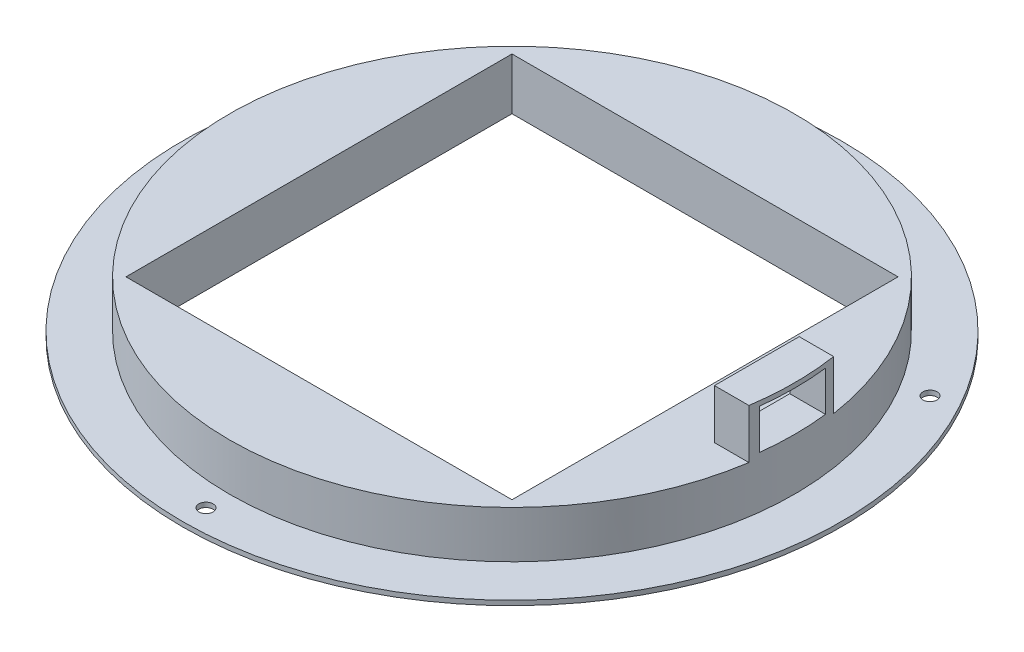
ISO-10303-21;
HEADER;
FILE_DESCRIPTION(('STEP AP214'),'2;1');
FILE_NAME('part.step','',(''),(''),'','','');
FILE_SCHEMA(('AUTOMOTIVE_DESIGN { 1 0 10303 214 1 1 1 1 }'));
ENDSEC;
DATA;
#1=APPLICATION_CONTEXT('core data for automotive mechanical design processes');
#2=APPLICATION_PROTOCOL_DEFINITION('international standard','automotive_design',2000,#1);
#3=PRODUCT_CONTEXT('',#1,'mechanical');
#4=PRODUCT('Part','Part','',(#3));
#5=PRODUCT_RELATED_PRODUCT_CATEGORY('part','',(#4));
#6=PRODUCT_DEFINITION_FORMATION('','',#4);
#7=PRODUCT_DEFINITION_CONTEXT('part definition',#1,'design');
#8=PRODUCT_DEFINITION('design','',#6,#7);
#9=PRODUCT_DEFINITION_SHAPE('','',#8);
#10=(LENGTH_UNIT() NAMED_UNIT(*) SI_UNIT(.MILLI.,.METRE.));
#11=(NAMED_UNIT(*) PLANE_ANGLE_UNIT() SI_UNIT($,.RADIAN.));
#12=(NAMED_UNIT(*) SI_UNIT($,.STERADIAN.) SOLID_ANGLE_UNIT());
#13=UNCERTAINTY_MEASURE_WITH_UNIT(LENGTH_MEASURE(1.E-05),#10,'distance_accuracy_value','');
#14=(GEOMETRIC_REPRESENTATION_CONTEXT(3) GLOBAL_UNCERTAINTY_ASSIGNED_CONTEXT((#13)) GLOBAL_UNIT_ASSIGNED_CONTEXT((#10,
#11,#12)) REPRESENTATION_CONTEXT('',''));
#15=CARTESIAN_POINT('',(0.,0.,0.));
#16=DIRECTION('',(0.,0.,1.));
#17=DIRECTION('',(1.,0.,0.));
#18=AXIS2_PLACEMENT_3D('',#15,#16,#17);
#19=CARTESIAN_POINT('',(-86.9016428172304,71.9761170199418,0.));
#20=DIRECTION('',(0.,1.,0.));
#21=DIRECTION('',(0.,0.,1.));
#22=AXIS2_PLACEMENT_3D('',#19,#20,#21);
#23=PLANE('',#22);
#24=DIRECTION('',(-1.,0.,0.));
#25=VECTOR('',#24,1.);
#26=CARTESIAN_POINT('',(32.4195169826252,71.9761170199418,-9.));
#27=LINE('',#26,#25);
#28=CARTESIAN_POINT('',(32.4195169826252,71.9761170199418,-9.));
#29=VERTEX_POINT('',#28);
#30=CARTESIAN_POINT('',(25.0983571827696,71.9761170199418,-9.));
#31=VERTEX_POINT('',#30);
#32=EDGE_CURVE('E162',#29,#31,#27,.T.);
#33=ORIENTED_EDGE('',*,*,#32,.F.);
#34=CARTESIAN_POINT('',(-26.9016428172304,71.9761170199418,0.));
#35=DIRECTION('',(0.,1.,0.));
#36=DIRECTION('',(0.,0.,1.));
#37=AXIS2_PLACEMENT_3D('',#34,#35,#36);
#38=CIRCLE('',#37,60.);
#39=CARTESIAN_POINT('',(32.4195169826252,71.9761170199418,9.));
#40=VERTEX_POINT('',#39);
#41=EDGE_CURVE('E11',#29,#40,#38,.T.);
#42=ORIENTED_EDGE('',*,*,#41,.T.);
#43=DIRECTION('',(1.,0.,0.));
#44=VECTOR('',#43,1.);
#45=CARTESIAN_POINT('',(25.0983571827696,71.9761170199418,9.));
#46=LINE('',#45,#44);
#47=CARTESIAN_POINT('',(25.0983571827696,71.9761170199418,9.));
#48=VERTEX_POINT('',#47);
#49=EDGE_CURVE('E171',#48,#40,#46,.T.);
#50=ORIENTED_EDGE('',*,*,#49,.F.);
#51=DIRECTION('',(0.,0.,1.));
#52=VECTOR('',#51,1.);
#53=CARTESIAN_POINT('',(25.0983571827696,71.9761170199418,-9.));
#54=LINE('',#53,#52);
#55=EDGE_CURVE('E157',#31,#48,#54,.T.);
#56=ORIENTED_EDGE('',*,*,#55,.F.);
#57=EDGE_LOOP('',(#33,#42,#50,#56));
#58=FACE_BOUND('',#57,.T.);
#59=DIRECTION('',(-1.,0.,0.));
#60=VECTOR('',#59,1.);
#61=CARTESIAN_POINT('',(14.0983571827696,71.9761170199418,-41.));
#62=LINE('',#61,#60);
#63=CARTESIAN_POINT('',(14.0983571827696,71.9761170199418,-41.));
#64=VERTEX_POINT('',#63);
#65=CARTESIAN_POINT('',(-67.9016428172304,71.9761170199418,-41.));
#66=VERTEX_POINT('',#65);
#67=EDGE_CURVE('E252',#64,#66,#62,.T.);
#68=ORIENTED_EDGE('',*,*,#67,.F.);
#69=DIRECTION('',(0.,0.,-1.));
#70=VECTOR('',#69,1.);
#71=CARTESIAN_POINT('',(14.0983571827696,71.9761170199418,41.));
#72=LINE('',#71,#70);
#73=CARTESIAN_POINT('',(14.0983571827696,71.9761170199418,41.));
#74=VERTEX_POINT('',#73);
#75=EDGE_CURVE('E260',#74,#64,#72,.T.);
#76=ORIENTED_EDGE('',*,*,#75,.F.);
#77=DIRECTION('',(1.,0.,0.));
#78=VECTOR('',#77,1.);
#79=CARTESIAN_POINT('',(14.0983571827696,71.9761170199418,41.));
#80=LINE('',#79,#78);
#81=CARTESIAN_POINT('',(-67.9016428172304,71.9761170199418,41.));
#82=VERTEX_POINT('',#81);
#83=EDGE_CURVE('E262',#82,#74,#80,.T.);
#84=ORIENTED_EDGE('',*,*,#83,.F.);
#85=DIRECTION('',(0.,0.,1.));
#86=VECTOR('',#85,1.);
#87=CARTESIAN_POINT('',(-67.9016428172304,71.9761170199418,41.));
#88=LINE('',#87,#86);
#89=EDGE_CURVE('E265',#66,#82,#88,.T.);
#90=ORIENTED_EDGE('',*,*,#89,.F.);
#91=EDGE_LOOP('',(#68,#76,#84,#90));
#92=FACE_BOUND('',#91,.T.);
#93=ADVANCED_FACE('F33',(#58,#92),#23,.T.);
#94=CARTESIAN_POINT('',(-26.9016428172304,46.9761170199418,0.));
#95=DIRECTION('',(0.,1.,0.));
#96=DIRECTION('',(0.,0.,1.));
#97=AXIS2_PLACEMENT_3D('',#94,#95,#96);
#98=CYLINDRICAL_SURFACE('',#97,60.);
#99=DIRECTION('',(0.,1.,0.));
#100=VECTOR('',#99,1.);
#101=CARTESIAN_POINT('',(32.688624844528,46.9761170199418,6.99999999999999));
#102=LINE('',#101,#100);
#103=CARTESIAN_POINT('',(32.688624844528,81.4761170199418,6.99999999999998));
#104=VERTEX_POINT('',#103);
#105=CARTESIAN_POINT('',(32.688624844528,72.9761170199418,6.99999999999998));
#106=VERTEX_POINT('',#105);
#107=EDGE_CURVE('E155',#104,#106,#102,.F.);
#108=ORIENTED_EDGE('',*,*,#107,.F.);
#109=CARTESIAN_POINT('',(-26.9016428172304,81.4761170199418,0.));
#110=DIRECTION('',(0.,1.,0.));
#111=DIRECTION('',(0.,0.,1.));
#112=AXIS2_PLACEMENT_3D('',#109,#110,#111);
#113=CIRCLE('',#112,60.);
#114=CARTESIAN_POINT('',(32.688624844528,81.4761170199418,-7.00000000000001));
#115=VERTEX_POINT('',#114);
#116=EDGE_CURVE('E148',#115,#104,#113,.F.);
#117=ORIENTED_EDGE('',*,*,#116,.F.);
#118=DIRECTION('',(0.,1.,0.));
#119=VECTOR('',#118,1.);
#120=CARTESIAN_POINT('',(32.688624844528,46.9761170199418,-7.00000000000001));
#121=LINE('',#120,#119);
#122=CARTESIAN_POINT('',(32.688624844528,72.9761170199418,-7.00000000000002));
#123=VERTEX_POINT('',#122);
#124=EDGE_CURVE('E128',#123,#115,#121,.T.);
#125=ORIENTED_EDGE('',*,*,#124,.F.);
#126=CARTESIAN_POINT('',(-26.9016428172304,72.9761170199418,0.));
#127=DIRECTION('',(0.,-1.,0.));
#128=DIRECTION('',(0.,0.,-1.));
#129=AXIS2_PLACEMENT_3D('',#126,#127,#128);
#130=CIRCLE('',#129,60.);
#131=EDGE_CURVE('E153',#106,#123,#130,.F.);
#132=ORIENTED_EDGE('',*,*,#131,.F.);
#133=EDGE_LOOP('',(#108,#117,#125,#132));
#134=FACE_BOUND('',#133,.T.);
#135=CARTESIAN_POINT('',(-26.9016428172304,61.9761170199418,0.));
#136=DIRECTION('',(0.,1.,0.));
#137=DIRECTION('',(0.,0.,1.));
#138=AXIS2_PLACEMENT_3D('',#135,#136,#137);
#139=CIRCLE('',#138,60.);
#140=CARTESIAN_POINT('',(-26.9016428172304,61.9761170199418,60.));
#141=VERTEX_POINT('',#140);
#142=EDGE_CURVE('E41',#141,#141,#139,.T.);
#143=ORIENTED_EDGE('',*,*,#142,.T.);
#144=EDGE_LOOP('',(#143));
#145=FACE_BOUND('',#144,.T.);
#146=ORIENTED_EDGE('',*,*,#41,.F.);
#147=DIRECTION('',(0.,-1.,0.));
#148=VECTOR('',#147,1.);
#149=CARTESIAN_POINT('',(32.4195169826252,82.4761170199418,-9.));
#150=LINE('',#149,#148);
#151=CARTESIAN_POINT('',(32.4195169826252,82.4761170199418,-9.));
#152=VERTEX_POINT('',#151);
#153=EDGE_CURVE('E183',#152,#29,#150,.T.);
#154=ORIENTED_EDGE('',*,*,#153,.F.);
#155=CARTESIAN_POINT('',(-26.9016428172308,82.4761170199418,0.));
#156=DIRECTION('',(0.,1.,0.));
#157=DIRECTION('',(0.,0.,-1.));
#158=AXIS2_PLACEMENT_3D('',#155,#156,#157);
#159=CIRCLE('',#158,60.0000000000004);
#160=CARTESIAN_POINT('',(32.4195169826252,82.4761170199418,9.));
#161=VERTEX_POINT('',#160);
#162=EDGE_CURVE('E164',#161,#152,#159,.T.);
#163=ORIENTED_EDGE('',*,*,#162,.F.);
#164=DIRECTION('',(0.,-1.,0.));
#165=VECTOR('',#164,1.);
#166=CARTESIAN_POINT('',(32.4195169826252,82.4761170199418,9.));
#167=LINE('',#166,#165);
#168=EDGE_CURVE('E179',#161,#40,#167,.T.);
#169=ORIENTED_EDGE('',*,*,#168,.T.);
#170=EDGE_LOOP('',(#146,#154,#163,#169));
#171=FACE_BOUND('',#170,.T.);
#172=ADVANCED_FACE('F220',(#134,#145,#171),#98,.T.);
#173=CARTESIAN_POINT('',(-86.9016428172304,61.9761170199418,0.));
#174=DIRECTION('',(0.,1.,0.));
#175=DIRECTION('',(0.,0.,1.));
#176=AXIS2_PLACEMENT_3D('',#173,#174,#175);
#177=PLANE('',#176);
#178=CARTESIAN_POINT('',(29.3900084287585,61.9761170199418,-32.4999999999995));
#179=DIRECTION('',(0.,1.,0.));
#180=DIRECTION('',(0.,0.,1.));
#181=AXIS2_PLACEMENT_3D('',#178,#179,#180);
#182=CIRCLE('',#181,1.5);
#183=CARTESIAN_POINT('',(29.3900084287585,61.9761170199418,-30.9999999999995));
#184=VERTEX_POINT('',#183);
#185=EDGE_CURVE('E209',#184,#184,#182,.T.);
#186=ORIENTED_EDGE('',*,*,#185,.F.);
#187=EDGE_LOOP('',(#186));
#188=FACE_BOUND('',#187,.T.);
#189=CARTESIAN_POINT('',(-83.1932940632187,61.9761170199418,-32.5000000000002));
#190=DIRECTION('',(0.,1.,0.));
#191=DIRECTION('',(0.,0.,1.));
#192=AXIS2_PLACEMENT_3D('',#189,#190,#191);
#193=CIRCLE('',#192,1.5);
#194=CARTESIAN_POINT('',(-83.1932940632187,61.9761170199418,-31.0000000000002));
#195=VERTEX_POINT('',#194);
#196=EDGE_CURVE('E199',#195,#195,#193,.T.);
#197=ORIENTED_EDGE('',*,*,#196,.F.);
#198=EDGE_LOOP('',(#197));
#199=FACE_BOUND('',#198,.T.);
#200=CARTESIAN_POINT('',(-26.9016428172304,61.9761170199418,65.));
#201=DIRECTION('',(0.,1.,0.));
#202=DIRECTION('',(0.,0.,1.));
#203=AXIS2_PLACEMENT_3D('',#200,#201,#202);
#204=CIRCLE('',#203,1.5);
#205=CARTESIAN_POINT('',(-26.9016428172304,61.9761170199418,66.5));
#206=VERTEX_POINT('',#205);
#207=EDGE_CURVE('E196',#206,#206,#204,.T.);
#208=ORIENTED_EDGE('',*,*,#207,.F.);
#209=EDGE_LOOP('',(#208));
#210=FACE_BOUND('',#209,.T.);
#211=CARTESIAN_POINT('',(-26.9016428172304,61.9761170199418,0.));
#212=DIRECTION('',(0.,1.,0.));
#213=DIRECTION('',(0.,0.,1.));
#214=AXIS2_PLACEMENT_3D('',#211,#212,#213);
#215=CIRCLE('',#214,70.);
#216=CARTESIAN_POINT('',(-26.9016428172304,61.9761170199418,70.));
#217=VERTEX_POINT('',#216);
#218=EDGE_CURVE('E228',#217,#217,#215,.T.);
#219=ORIENTED_EDGE('',*,*,#218,.T.);
#220=EDGE_LOOP('',(#219));
#221=FACE_BOUND('',#220,.T.);
#222=ORIENTED_EDGE('',*,*,#142,.F.);
#223=EDGE_LOOP('',(#222));
#224=FACE_BOUND('',#223,.T.);
#225=ADVANCED_FACE('F216',(#188,#199,#210,#221,#224),#177,.T.);
#226=CARTESIAN_POINT('',(-26.9016428172304,46.9761170199418,0.));
#227=DIRECTION('',(0.,1.,0.));
#228=DIRECTION('',(0.,0.,1.));
#229=AXIS2_PLACEMENT_3D('',#226,#227,#228);
#230=CYLINDRICAL_SURFACE('',#229,70.);
#231=CARTESIAN_POINT('',(-26.9016428172304,60.9761170199418,0.));
#232=DIRECTION('',(0.,1.,0.));
#233=DIRECTION('',(0.,0.,1.));
#234=AXIS2_PLACEMENT_3D('',#231,#232,#233);
#235=CIRCLE('',#234,70.);
#236=CARTESIAN_POINT('',(-26.9016428172304,60.9761170199418,70.));
#237=VERTEX_POINT('',#236);
#238=EDGE_CURVE('E233',#237,#237,#235,.T.);
#239=ORIENTED_EDGE('',*,*,#238,.T.);
#240=EDGE_LOOP('',(#239));
#241=FACE_BOUND('',#240,.T.);
#242=ORIENTED_EDGE('',*,*,#218,.F.);
#243=EDGE_LOOP('',(#242));
#244=FACE_BOUND('',#243,.T.);
#245=ADVANCED_FACE('F219',(#241,#244),#230,.T.);
#246=CARTESIAN_POINT('',(-96.9016428172304,60.9761170199418,0.));
#247=DIRECTION('',(0.,-1.,0.));
#248=DIRECTION('',(0.,0.,-1.));
#249=AXIS2_PLACEMENT_3D('',#246,#247,#248);
#250=PLANE('',#249);
#251=CARTESIAN_POINT('',(29.3900084287585,60.9761170199418,-32.4999999999995));
#252=DIRECTION('',(0.,-1.,0.));
#253=DIRECTION('',(0.,0.,-1.));
#254=AXIS2_PLACEMENT_3D('',#251,#252,#253);
#255=CIRCLE('',#254,1.5);
#256=CARTESIAN_POINT('',(29.3900084287585,60.9761170199418,-33.9999999999995));
#257=VERTEX_POINT('',#256);
#258=EDGE_CURVE('E36',#257,#257,#255,.T.);
#259=ORIENTED_EDGE('',*,*,#258,.F.);
#260=EDGE_LOOP('',(#259));
#261=FACE_BOUND('',#260,.T.);
#262=CARTESIAN_POINT('',(-83.1932940632187,60.9761170199418,-32.5000000000002));
#263=DIRECTION('',(0.,-1.,0.));
#264=DIRECTION('',(0.,0.,-1.));
#265=AXIS2_PLACEMENT_3D('',#262,#263,#264);
#266=CIRCLE('',#265,1.5);
#267=CARTESIAN_POINT('',(-83.1932940632187,60.9761170199418,-34.0000000000003));
#268=VERTEX_POINT('',#267);
#269=EDGE_CURVE('E197',#268,#268,#266,.T.);
#270=ORIENTED_EDGE('',*,*,#269,.F.);
#271=EDGE_LOOP('',(#270));
#272=FACE_BOUND('',#271,.T.);
#273=CARTESIAN_POINT('',(-26.9016428172304,60.9761170199418,65.));
#274=DIRECTION('',(0.,-1.,0.));
#275=DIRECTION('',(0.,0.,-1.));
#276=AXIS2_PLACEMENT_3D('',#273,#274,#275);
#277=CIRCLE('',#276,1.5);
#278=CARTESIAN_POINT('',(-26.9016428172304,60.9761170199418,63.5));
#279=VERTEX_POINT('',#278);
#280=EDGE_CURVE('E194',#279,#279,#277,.T.);
#281=ORIENTED_EDGE('',*,*,#280,.F.);
#282=EDGE_LOOP('',(#281));
#283=FACE_BOUND('',#282,.T.);
#284=DIRECTION('',(0.,0.,-1.));
#285=VECTOR('',#284,1.);
#286=CARTESIAN_POINT('',(-67.9016428172304,60.9761170199418,0.));
#287=LINE('',#286,#285);
#288=CARTESIAN_POINT('',(-67.9016428172304,60.9761170199418,41.));
#289=VERTEX_POINT('',#288);
#290=CARTESIAN_POINT('',(-67.9016428172304,60.9761170199418,-41.));
#291=VERTEX_POINT('',#290);
#292=EDGE_CURVE('E239',#289,#291,#287,.T.);
#293=ORIENTED_EDGE('',*,*,#292,.F.);
#294=DIRECTION('',(-1.,0.,0.));
#295=VECTOR('',#294,1.);
#296=CARTESIAN_POINT('',(-96.9016428172304,60.9761170199418,41.));
#297=LINE('',#296,#295);
#298=CARTESIAN_POINT('',(14.0983571827696,60.9761170199418,41.));
#299=VERTEX_POINT('',#298);
#300=EDGE_CURVE('E245',#299,#289,#297,.T.);
#301=ORIENTED_EDGE('',*,*,#300,.F.);
#302=DIRECTION('',(0.,0.,1.));
#303=VECTOR('',#302,1.);
#304=CARTESIAN_POINT('',(14.0983571827696,60.9761170199418,0.));
#305=LINE('',#304,#303);
#306=CARTESIAN_POINT('',(14.0983571827696,60.9761170199418,-41.));
#307=VERTEX_POINT('',#306);
#308=EDGE_CURVE('E243',#307,#299,#305,.T.);
#309=ORIENTED_EDGE('',*,*,#308,.F.);
#310=DIRECTION('',(1.,0.,0.));
#311=VECTOR('',#310,1.);
#312=CARTESIAN_POINT('',(-96.9016428172304,60.9761170199418,-41.));
#313=LINE('',#312,#311);
#314=EDGE_CURVE('E241',#291,#307,#313,.T.);
#315=ORIENTED_EDGE('',*,*,#314,.F.);
#316=EDGE_LOOP('',(#293,#301,#309,#315));
#317=FACE_BOUND('',#316,.T.);
#318=ORIENTED_EDGE('',*,*,#238,.F.);
#319=EDGE_LOOP('',(#318));
#320=FACE_BOUND('',#319,.T.);
#321=ADVANCED_FACE('F306',(#261,#272,#283,#317,#320),#250,.T.);
#322=CARTESIAN_POINT('',(-67.9016428172304,60.4761170199418,41.));
#323=DIRECTION('',(-1.,0.,0.));
#324=DIRECTION('',(0.,0.,1.));
#325=AXIS2_PLACEMENT_3D('',#322,#323,#324);
#326=PLANE('',#325);
#327=ORIENTED_EDGE('',*,*,#292,.T.);
#328=DIRECTION('',(0.,1.,0.));
#329=VECTOR('',#328,1.);
#330=CARTESIAN_POINT('',(-67.9016428172304,60.4761170199418,-41.));
#331=LINE('',#330,#329);
#332=EDGE_CURVE('E247',#291,#66,#331,.T.);
#333=ORIENTED_EDGE('',*,*,#332,.T.);
#334=ORIENTED_EDGE('',*,*,#89,.T.);
#335=DIRECTION('',(0.,1.,0.));
#336=VECTOR('',#335,1.);
#337=CARTESIAN_POINT('',(-67.9016428172304,60.4761170199418,41.));
#338=LINE('',#337,#336);
#339=EDGE_CURVE('E248',#289,#82,#338,.T.);
#340=ORIENTED_EDGE('',*,*,#339,.F.);
#341=EDGE_LOOP('',(#327,#333,#334,#340));
#342=FACE_BOUND('',#341,.T.);
#343=ADVANCED_FACE('F310',(#342),#326,.F.);
#344=CARTESIAN_POINT('',(14.0983571827696,60.4761170199418,-41.));
#345=DIRECTION('',(0.,0.,-1.));
#346=DIRECTION('',(-1.,0.,0.));
#347=AXIS2_PLACEMENT_3D('',#344,#345,#346);
#348=PLANE('',#347);
#349=ORIENTED_EDGE('',*,*,#314,.T.);
#350=DIRECTION('',(0.,1.,0.));
#351=VECTOR('',#350,1.);
#352=CARTESIAN_POINT('',(14.0983571827696,60.4761170199418,-41.));
#353=LINE('',#352,#351);
#354=EDGE_CURVE('E254',#307,#64,#353,.T.);
#355=ORIENTED_EDGE('',*,*,#354,.T.);
#356=ORIENTED_EDGE('',*,*,#67,.T.);
#357=ORIENTED_EDGE('',*,*,#332,.F.);
#358=EDGE_LOOP('',(#349,#355,#356,#357));
#359=FACE_BOUND('',#358,.T.);
#360=ADVANCED_FACE('F314',(#359),#348,.F.);
#361=CARTESIAN_POINT('',(14.0983571827696,60.4761170199418,41.));
#362=DIRECTION('',(1.,0.,0.));
#363=DIRECTION('',(0.,0.,-1.));
#364=AXIS2_PLACEMENT_3D('',#361,#362,#363);
#365=PLANE('',#364);
#366=ORIENTED_EDGE('',*,*,#308,.T.);
#367=DIRECTION('',(0.,1.,0.));
#368=VECTOR('',#367,1.);
#369=CARTESIAN_POINT('',(14.0983571827696,60.4761170199418,41.));
#370=LINE('',#369,#368);
#371=EDGE_CURVE('E251',#299,#74,#370,.T.);
#372=ORIENTED_EDGE('',*,*,#371,.T.);
#373=ORIENTED_EDGE('',*,*,#75,.T.);
#374=ORIENTED_EDGE('',*,*,#354,.F.);
#375=EDGE_LOOP('',(#366,#372,#373,#374));
#376=FACE_BOUND('',#375,.T.);
#377=ADVANCED_FACE('F319',(#376),#365,.F.);
#378=CARTESIAN_POINT('',(14.0983571827696,60.4761170199418,41.));
#379=DIRECTION('',(0.,0.,1.));
#380=DIRECTION('',(1.,0.,0.));
#381=AXIS2_PLACEMENT_3D('',#378,#379,#380);
#382=PLANE('',#381);
#383=ORIENTED_EDGE('',*,*,#300,.T.);
#384=ORIENTED_EDGE('',*,*,#339,.T.);
#385=ORIENTED_EDGE('',*,*,#83,.T.);
#386=ORIENTED_EDGE('',*,*,#371,.F.);
#387=EDGE_LOOP('',(#383,#384,#385,#386));
#388=FACE_BOUND('',#387,.T.);
#389=ADVANCED_FACE('F316',(#388),#382,.F.);
#390=CARTESIAN_POINT('',(25.0983571827696,82.4761170199418,-9.));
#391=DIRECTION('',(1.,0.,0.));
#392=DIRECTION('',(0.,0.,-1.));
#393=AXIS2_PLACEMENT_3D('',#390,#391,#392);
#394=PLANE('',#393);
#395=DIRECTION('',(0.,0.,-1.));
#396=VECTOR('',#395,1.);
#397=CARTESIAN_POINT('',(25.0983571827696,81.4761170199418,-7.00000000000002));
#398=LINE('',#397,#396);
#399=CARTESIAN_POINT('',(25.0983571827696,81.4761170199418,6.99999999999998));
#400=VERTEX_POINT('',#399);
#401=CARTESIAN_POINT('',(25.0983571827696,81.4761170199418,-7.00000000000002));
#402=VERTEX_POINT('',#401);
#403=EDGE_CURVE('E134',#400,#402,#398,.T.);
#404=ORIENTED_EDGE('',*,*,#403,.F.);
#405=DIRECTION('',(0.,1.,0.));
#406=VECTOR('',#405,1.);
#407=CARTESIAN_POINT('',(25.0983571827696,81.4761170199418,6.99999999999998));
#408=LINE('',#407,#406);
#409=CARTESIAN_POINT('',(25.0983571827696,72.9761170199418,6.99999999999999));
#410=VERTEX_POINT('',#409);
#411=EDGE_CURVE('E57',#410,#400,#408,.T.);
#412=ORIENTED_EDGE('',*,*,#411,.F.);
#413=DIRECTION('',(0.,0.,1.));
#414=VECTOR('',#413,1.);
#415=CARTESIAN_POINT('',(25.0983571827696,72.9761170199418,-7.00000000000002));
#416=LINE('',#415,#414);
#417=CARTESIAN_POINT('',(25.0983571827696,72.9761170199418,-7.00000000000002));
#418=VERTEX_POINT('',#417);
#419=EDGE_CURVE('E141',#418,#410,#416,.T.);
#420=ORIENTED_EDGE('',*,*,#419,.F.);
#421=DIRECTION('',(0.,-1.,0.));
#422=VECTOR('',#421,1.);
#423=CARTESIAN_POINT('',(25.0983571827696,81.4761170199418,-7.00000000000002));
#424=LINE('',#423,#422);
#425=EDGE_CURVE('E125',#402,#418,#424,.T.);
#426=ORIENTED_EDGE('',*,*,#425,.F.);
#427=EDGE_LOOP('',(#404,#412,#420,#426));
#428=FACE_BOUND('',#427,.T.);
#429=ORIENTED_EDGE('',*,*,#55,.T.);
#430=DIRECTION('',(0.,-1.,0.));
#431=VECTOR('',#430,1.);
#432=CARTESIAN_POINT('',(25.0983571827696,82.4761170199418,9.));
#433=LINE('',#432,#431);
#434=CARTESIAN_POINT('',(25.0983571827696,82.4761170199418,9.));
#435=VERTEX_POINT('',#434);
#436=EDGE_CURVE('E182',#435,#48,#433,.T.);
#437=ORIENTED_EDGE('',*,*,#436,.F.);
#438=DIRECTION('',(0.,0.,1.));
#439=VECTOR('',#438,1.);
#440=CARTESIAN_POINT('',(25.0983571827696,82.4761170199418,-9.));
#441=LINE('',#440,#439);
#442=CARTESIAN_POINT('',(25.0983571827696,82.4761170199418,-9.));
#443=VERTEX_POINT('',#442);
#444=EDGE_CURVE('E158',#443,#435,#441,.T.);
#445=ORIENTED_EDGE('',*,*,#444,.F.);
#446=DIRECTION('',(0.,-1.,0.));
#447=VECTOR('',#446,1.);
#448=CARTESIAN_POINT('',(25.0983571827696,82.4761170199418,-9.));
#449=LINE('',#448,#447);
#450=EDGE_CURVE('E168',#443,#31,#449,.T.);
#451=ORIENTED_EDGE('',*,*,#450,.T.);
#452=EDGE_LOOP('',(#429,#437,#445,#451));
#453=FACE_BOUND('',#452,.T.);
#454=ADVANCED_FACE('F138',(#428,#453),#394,.F.);
#455=CARTESIAN_POINT('',(25.0983571827696,82.4761170199418,9.));
#456=DIRECTION('',(0.,0.,-1.));
#457=DIRECTION('',(-1.,0.,0.));
#458=AXIS2_PLACEMENT_3D('',#455,#456,#457);
#459=PLANE('',#458);
#460=ORIENTED_EDGE('',*,*,#49,.T.);
#461=ORIENTED_EDGE('',*,*,#168,.F.);
#462=DIRECTION('',(1.,0.,0.));
#463=VECTOR('',#462,1.);
#464=CARTESIAN_POINT('',(25.0983571827696,82.4761170199418,9.));
#465=LINE('',#464,#463);
#466=EDGE_CURVE('E161',#435,#161,#465,.T.);
#467=ORIENTED_EDGE('',*,*,#466,.F.);
#468=ORIENTED_EDGE('',*,*,#436,.T.);
#469=EDGE_LOOP('',(#460,#461,#467,#468));
#470=FACE_BOUND('',#469,.T.);
#471=ADVANCED_FACE('F269',(#470),#459,.F.);
#472=CARTESIAN_POINT('',(32.4195169826252,82.4761170199418,-9.));
#473=DIRECTION('',(0.,0.,1.));
#474=DIRECTION('',(1.,0.,0.));
#475=AXIS2_PLACEMENT_3D('',#472,#473,#474);
#476=PLANE('',#475);
#477=ORIENTED_EDGE('',*,*,#32,.T.);
#478=ORIENTED_EDGE('',*,*,#450,.F.);
#479=DIRECTION('',(-1.,0.,0.));
#480=VECTOR('',#479,1.);
#481=CARTESIAN_POINT('',(32.4195169826252,82.4761170199418,-9.));
#482=LINE('',#481,#480);
#483=EDGE_CURVE('E166',#152,#443,#482,.T.);
#484=ORIENTED_EDGE('',*,*,#483,.F.);
#485=ORIENTED_EDGE('',*,*,#153,.T.);
#486=EDGE_LOOP('',(#477,#478,#484,#485));
#487=FACE_BOUND('',#486,.T.);
#488=ADVANCED_FACE('F278',(#487),#476,.F.);
#489=CARTESIAN_POINT('',(-26.9016428172308,82.4761170199418,0.));
#490=DIRECTION('',(0.,-1.,0.));
#491=DIRECTION('',(0.,0.,-1.));
#492=AXIS2_PLACEMENT_3D('',#489,#490,#491);
#493=PLANE('',#492);
#494=ORIENTED_EDGE('',*,*,#444,.T.);
#495=ORIENTED_EDGE('',*,*,#466,.T.);
#496=ORIENTED_EDGE('',*,*,#162,.T.);
#497=ORIENTED_EDGE('',*,*,#483,.T.);
#498=EDGE_LOOP('',(#494,#495,#496,#497));
#499=FACE_BOUND('',#498,.T.);
#500=ADVANCED_FACE('F284',(#499),#493,.F.);
#501=CARTESIAN_POINT('',(35.5983571827696,81.4761170199418,6.99999999999998));
#502=DIRECTION('',(0.,0.,1.));
#503=DIRECTION('',(0.,-1.,0.));
#504=AXIS2_PLACEMENT_3D('',#501,#502,#503);
#505=PLANE('',#504);
#506=ORIENTED_EDGE('',*,*,#107,.T.);
#507=DIRECTION('',(-1.,0.,0.));
#508=VECTOR('',#507,1.);
#509=CARTESIAN_POINT('',(35.5983571827696,72.9761170199418,6.99999999999998));
#510=LINE('',#509,#508);
#511=EDGE_CURVE('E146',#106,#410,#510,.T.);
#512=ORIENTED_EDGE('',*,*,#511,.T.);
#513=ORIENTED_EDGE('',*,*,#411,.T.);
#514=DIRECTION('',(-1.,0.,0.));
#515=VECTOR('',#514,1.);
#516=CARTESIAN_POINT('',(35.5983571827696,81.4761170199418,6.99999999999998));
#517=LINE('',#516,#515);
#518=EDGE_CURVE('E131',#104,#400,#517,.T.);
#519=ORIENTED_EDGE('',*,*,#518,.F.);
#520=EDGE_LOOP('',(#506,#512,#513,#519));
#521=FACE_BOUND('',#520,.T.);
#522=ADVANCED_FACE('F286',(#521),#505,.F.);
#523=CARTESIAN_POINT('',(35.5983571827696,72.9761170199418,-7.00000000000002));
#524=DIRECTION('',(0.,-1.,0.));
#525=DIRECTION('',(0.,0.,-1.));
#526=AXIS2_PLACEMENT_3D('',#523,#524,#525);
#527=PLANE('',#526);
#528=ORIENTED_EDGE('',*,*,#131,.T.);
#529=DIRECTION('',(-1.,0.,0.));
#530=VECTOR('',#529,1.);
#531=CARTESIAN_POINT('',(35.5983571827696,72.9761170199418,-7.00000000000002));
#532=LINE('',#531,#530);
#533=EDGE_CURVE('E130',#123,#418,#532,.T.);
#534=ORIENTED_EDGE('',*,*,#533,.T.);
#535=ORIENTED_EDGE('',*,*,#419,.T.);
#536=ORIENTED_EDGE('',*,*,#511,.F.);
#537=EDGE_LOOP('',(#528,#534,#535,#536));
#538=FACE_BOUND('',#537,.T.);
#539=ADVANCED_FACE('F292',(#538),#527,.F.);
#540=CARTESIAN_POINT('',(35.5983571827696,81.4761170199418,-7.00000000000002));
#541=DIRECTION('',(0.,0.,-1.));
#542=DIRECTION('',(-1.,0.,0.));
#543=AXIS2_PLACEMENT_3D('',#540,#541,#542);
#544=PLANE('',#543);
#545=ORIENTED_EDGE('',*,*,#124,.T.);
#546=DIRECTION('',(-1.,0.,0.));
#547=VECTOR('',#546,1.);
#548=CARTESIAN_POINT('',(35.5983571827696,81.4761170199418,-7.00000000000002));
#549=LINE('',#548,#547);
#550=EDGE_CURVE('E49',#115,#402,#549,.T.);
#551=ORIENTED_EDGE('',*,*,#550,.T.);
#552=ORIENTED_EDGE('',*,*,#425,.T.);
#553=ORIENTED_EDGE('',*,*,#533,.F.);
#554=EDGE_LOOP('',(#545,#551,#552,#553));
#555=FACE_BOUND('',#554,.T.);
#556=ADVANCED_FACE('F122',(#555),#544,.F.);
#557=CARTESIAN_POINT('',(35.5983571827696,81.4761170199418,-7.00000000000002));
#558=DIRECTION('',(0.,1.,0.));
#559=DIRECTION('',(0.,0.,1.));
#560=AXIS2_PLACEMENT_3D('',#557,#558,#559);
#561=PLANE('',#560);
#562=ORIENTED_EDGE('',*,*,#116,.T.);
#563=ORIENTED_EDGE('',*,*,#518,.T.);
#564=ORIENTED_EDGE('',*,*,#403,.T.);
#565=ORIENTED_EDGE('',*,*,#550,.F.);
#566=EDGE_LOOP('',(#562,#563,#564,#565));
#567=FACE_BOUND('',#566,.T.);
#568=ADVANCED_FACE('F135',(#567),#561,.F.);
#569=CARTESIAN_POINT('',(-26.9016428172304,51.9761170199418,65.));
#570=DIRECTION('',(0.,1.,0.));
#571=DIRECTION('',(0.,0.,1.));
#572=AXIS2_PLACEMENT_3D('',#569,#570,#571);
#573=CYLINDRICAL_SURFACE('',#572,1.5);
#574=ORIENTED_EDGE('',*,*,#280,.T.);
#575=EDGE_LOOP('',(#574));
#576=FACE_BOUND('',#575,.T.);
#577=ORIENTED_EDGE('',*,*,#207,.T.);
#578=EDGE_LOOP('',(#577));
#579=FACE_BOUND('',#578,.T.);
#580=ADVANCED_FACE('F384',(#576,#579),#573,.F.);
#581=CARTESIAN_POINT('',(-83.1932940632187,51.9761170199418,-32.5000000000002));
#582=DIRECTION('',(0.,1.,0.));
#583=DIRECTION('',(0.,0.,1.));
#584=AXIS2_PLACEMENT_3D('',#581,#582,#583);
#585=CYLINDRICAL_SURFACE('',#584,1.5);
#586=ORIENTED_EDGE('',*,*,#269,.T.);
#587=EDGE_LOOP('',(#586));
#588=FACE_BOUND('',#587,.T.);
#589=ORIENTED_EDGE('',*,*,#196,.T.);
#590=EDGE_LOOP('',(#589));
#591=FACE_BOUND('',#590,.T.);
#592=ADVANCED_FACE('F407',(#588,#591),#585,.F.);
#593=CARTESIAN_POINT('',(29.3900084287585,51.9761170199418,-32.4999999999995));
#594=DIRECTION('',(0.,1.,0.));
#595=DIRECTION('',(0.,0.,1.));
#596=AXIS2_PLACEMENT_3D('',#593,#594,#595);
#597=CYLINDRICAL_SURFACE('',#596,1.5);
#598=ORIENTED_EDGE('',*,*,#258,.T.);
#599=EDGE_LOOP('',(#598));
#600=FACE_BOUND('',#599,.T.);
#601=ORIENTED_EDGE('',*,*,#185,.T.);
#602=EDGE_LOOP('',(#601));
#603=FACE_BOUND('',#602,.T.);
#604=ADVANCED_FACE('F214',(#600,#603),#597,.F.);
#605=CLOSED_SHELL('',(#93,#172,#225,#245,#321,#343,#360,#377,#389,#454,#471,#488,#500,#522,#539,
#556,#568,#580,#592,#604));
#606=MANIFOLD_SOLID_BREP('B2',#605);
#607=ADVANCED_BREP_SHAPE_REPRESENTATION('',(#18,#606),#14);
#608=SHAPE_DEFINITION_REPRESENTATION(#9,#607);
ENDSEC;
END-ISO-10303-21;
